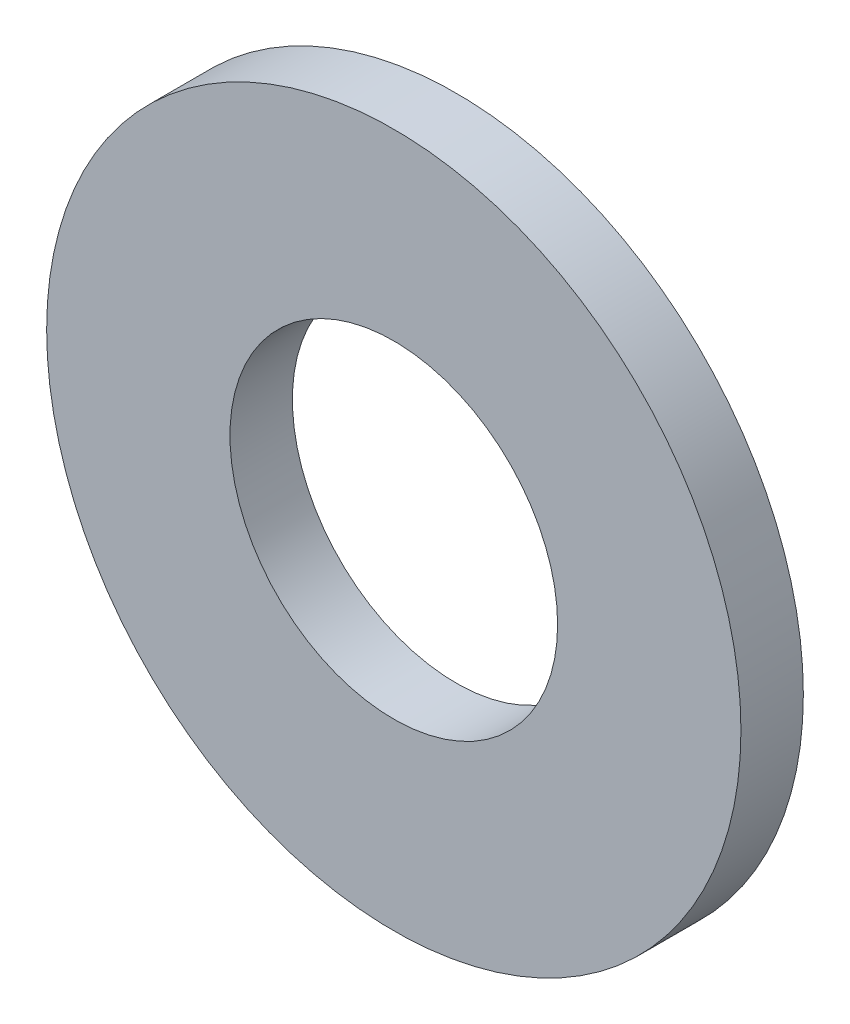
ISO-10303-21;
HEADER;
FILE_DESCRIPTION(('STEP AP214'),'2;1');
FILE_NAME('part.step','',(''),(''),'','','');
FILE_SCHEMA(('AUTOMOTIVE_DESIGN { 1 0 10303 214 1 1 1 1 }'));
ENDSEC;
DATA;
#1=APPLICATION_CONTEXT('core data for automotive mechanical design processes');
#2=APPLICATION_PROTOCOL_DEFINITION('international standard','automotive_design',2000,#1);
#3=PRODUCT_CONTEXT('',#1,'mechanical');
#4=PRODUCT('Part','Part','',(#3));
#5=PRODUCT_RELATED_PRODUCT_CATEGORY('part','',(#4));
#6=PRODUCT_DEFINITION_FORMATION('','',#4);
#7=PRODUCT_DEFINITION_CONTEXT('part definition',#1,'design');
#8=PRODUCT_DEFINITION('design','',#6,#7);
#9=PRODUCT_DEFINITION_SHAPE('','',#8);
#10=(LENGTH_UNIT() NAMED_UNIT(*) SI_UNIT(.MILLI.,.METRE.));
#11=(NAMED_UNIT(*) PLANE_ANGLE_UNIT() SI_UNIT($,.RADIAN.));
#12=(NAMED_UNIT(*) SI_UNIT($,.STERADIAN.) SOLID_ANGLE_UNIT());
#13=UNCERTAINTY_MEASURE_WITH_UNIT(LENGTH_MEASURE(1.E-05),#10,'distance_accuracy_value','');
#14=(GEOMETRIC_REPRESENTATION_CONTEXT(3) GLOBAL_UNCERTAINTY_ASSIGNED_CONTEXT((#13)) GLOBAL_UNIT_ASSIGNED_CONTEXT((#10,
#11,#12)) REPRESENTATION_CONTEXT('',''));
#15=CARTESIAN_POINT('',(0.,0.,0.));
#16=DIRECTION('',(0.,0.,1.));
#17=DIRECTION('',(1.,0.,0.));
#18=AXIS2_PLACEMENT_3D('',#15,#16,#17);
#19=CARTESIAN_POINT('',(0.,0.,-0.8));
#20=DIRECTION('',(0.,0.,1.));
#21=DIRECTION('',(1.,0.,0.));
#22=AXIS2_PLACEMENT_3D('',#19,#20,#21);
#23=CYLINDRICAL_SURFACE('',#22,4.45);
#24=CARTESIAN_POINT('',(0.,0.,-0.8));
#25=DIRECTION('',(0.,0.,1.));
#26=DIRECTION('',(1.,0.,0.));
#27=AXIS2_PLACEMENT_3D('',#24,#25,#26);
#28=CIRCLE('',#27,4.45);
#29=CARTESIAN_POINT('',(4.45,0.,-0.8));
#30=VERTEX_POINT('',#29);
#31=EDGE_CURVE('E10',#30,#30,#28,.T.);
#32=ORIENTED_EDGE('',*,*,#31,.T.);
#33=EDGE_LOOP('',(#32));
#34=FACE_BOUND('',#33,.T.);
#35=CARTESIAN_POINT('',(0.,0.,0.));
#36=DIRECTION('',(0.,0.,1.));
#37=DIRECTION('',(1.,0.,0.));
#38=AXIS2_PLACEMENT_3D('',#35,#36,#37);
#39=CIRCLE('',#38,4.45);
#40=CARTESIAN_POINT('',(4.45,0.,0.));
#41=VERTEX_POINT('',#40);
#42=EDGE_CURVE('E35',#41,#41,#39,.T.);
#43=ORIENTED_EDGE('',*,*,#42,.F.);
#44=EDGE_LOOP('',(#43));
#45=FACE_BOUND('',#44,.T.);
#46=ADVANCED_FACE('F32',(#34,#45),#23,.T.);
#47=CARTESIAN_POINT('',(0.,0.,-0.8));
#48=DIRECTION('',(0.,0.,1.));
#49=DIRECTION('',(1.,0.,0.));
#50=AXIS2_PLACEMENT_3D('',#47,#48,#49);
#51=PLANE('',#50);
#52=CARTESIAN_POINT('',(0.,0.,-0.8));
#53=DIRECTION('',(0.,0.,1.));
#54=DIRECTION('',(1.,0.,0.));
#55=AXIS2_PLACEMENT_3D('',#52,#53,#54);
#56=CIRCLE('',#55,2.1);
#57=CARTESIAN_POINT('',(2.1,0.,-0.8));
#58=VERTEX_POINT('',#57);
#59=EDGE_CURVE('E42',#58,#58,#56,.T.);
#60=ORIENTED_EDGE('',*,*,#59,.T.);
#61=EDGE_LOOP('',(#60));
#62=FACE_BOUND('',#61,.T.);
#63=ORIENTED_EDGE('',*,*,#31,.F.);
#64=EDGE_LOOP('',(#63));
#65=FACE_BOUND('',#64,.T.);
#66=ADVANCED_FACE('F50',(#62,#65),#51,.F.);
#67=CARTESIAN_POINT('',(0.,0.,0.));
#68=DIRECTION('',(0.,0.,1.));
#69=DIRECTION('',(1.,0.,0.));
#70=AXIS2_PLACEMENT_3D('',#67,#68,#69);
#71=PLANE('',#70);
#72=CARTESIAN_POINT('',(0.,0.,0.));
#73=DIRECTION('',(0.,0.,1.));
#74=DIRECTION('',(1.,0.,0.));
#75=AXIS2_PLACEMENT_3D('',#72,#73,#74);
#76=CIRCLE('',#75,2.1);
#77=CARTESIAN_POINT('',(2.1,0.,0.));
#78=VERTEX_POINT('',#77);
#79=EDGE_CURVE('E44',#78,#78,#76,.T.);
#80=ORIENTED_EDGE('',*,*,#79,.F.);
#81=EDGE_LOOP('',(#80));
#82=FACE_BOUND('',#81,.T.);
#83=ORIENTED_EDGE('',*,*,#42,.T.);
#84=EDGE_LOOP('',(#83));
#85=FACE_BOUND('',#84,.T.);
#86=ADVANCED_FACE('F56',(#82,#85),#71,.T.);
#87=CARTESIAN_POINT('',(0.,0.,-0.8));
#88=DIRECTION('',(0.,0.,1.));
#89=DIRECTION('',(1.,0.,0.));
#90=AXIS2_PLACEMENT_3D('',#87,#88,#89);
#91=CYLINDRICAL_SURFACE('',#90,2.1);
#92=ORIENTED_EDGE('',*,*,#59,.F.);
#93=EDGE_LOOP('',(#92));
#94=FACE_BOUND('',#93,.T.);
#95=ORIENTED_EDGE('',*,*,#79,.T.);
#96=EDGE_LOOP('',(#95));
#97=FACE_BOUND('',#96,.T.);
#98=ADVANCED_FACE('F53',(#94,#97),#91,.F.);
#99=CLOSED_SHELL('',(#46,#66,#86,#98));
#100=MANIFOLD_SOLID_BREP('B2',#99);
#101=ADVANCED_BREP_SHAPE_REPRESENTATION('',(#18,#100),#14);
#102=SHAPE_DEFINITION_REPRESENTATION(#9,#101);
ENDSEC;
END-ISO-10303-21;
